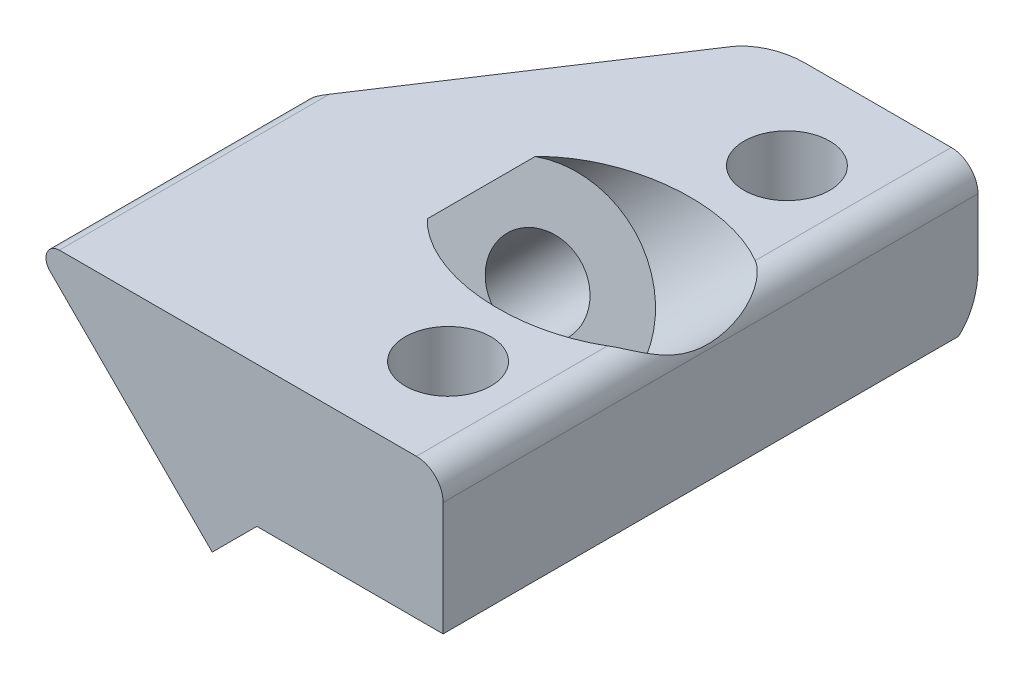
ISO-10303-21;
HEADER;
FILE_DESCRIPTION(('STEP AP214'),'2;1');
FILE_NAME('part.step','',(''),(''),'','','');
FILE_SCHEMA(('AUTOMOTIVE_DESIGN { 1 0 10303 214 1 1 1 1 }'));
ENDSEC;
DATA;
#1=APPLICATION_CONTEXT('core data for automotive mechanical design processes');
#2=APPLICATION_PROTOCOL_DEFINITION('international standard','automotive_design',2000,#1);
#3=PRODUCT_CONTEXT('',#1,'mechanical');
#4=PRODUCT('Part','Part','',(#3));
#5=PRODUCT_RELATED_PRODUCT_CATEGORY('part','',(#4));
#6=PRODUCT_DEFINITION_FORMATION('','',#4);
#7=PRODUCT_DEFINITION_CONTEXT('part definition',#1,'design');
#8=PRODUCT_DEFINITION('design','',#6,#7);
#9=PRODUCT_DEFINITION_SHAPE('','',#8);
#10=(LENGTH_UNIT() NAMED_UNIT(*) SI_UNIT(.MILLI.,.METRE.));
#11=(NAMED_UNIT(*) PLANE_ANGLE_UNIT() SI_UNIT($,.RADIAN.));
#12=(NAMED_UNIT(*) SI_UNIT($,.STERADIAN.) SOLID_ANGLE_UNIT());
#13=UNCERTAINTY_MEASURE_WITH_UNIT(LENGTH_MEASURE(1.E-05),#10,'distance_accuracy_value','');
#14=(GEOMETRIC_REPRESENTATION_CONTEXT(3) GLOBAL_UNCERTAINTY_ASSIGNED_CONTEXT((#13)) GLOBAL_UNIT_ASSIGNED_CONTEXT((#10,
#11,#12)) REPRESENTATION_CONTEXT('',''));
#15=CARTESIAN_POINT('',(0.,0.,0.));
#16=DIRECTION('',(0.,0.,1.));
#17=DIRECTION('',(1.,0.,0.));
#18=AXIS2_PLACEMENT_3D('',#15,#16,#17);
#19=CARTESIAN_POINT('',(8.59176280969094,10.3021303836136,-5.00000000000001));
#20=DIRECTION('',(-0.707106781186548,0.707106781186548,0.));
#21=DIRECTION('',(-0.707106781186548,-0.707106781186548,0.));
#22=AXIS2_PLACEMENT_3D('',#19,#20,#21);
#23=PLANE('',#22);
#24=CARTESIAN_POINT('',(12.0763491861041,13.7867167600267,16.3350447688493));
#25=DIRECTION('',(-0.707106781186548,0.707106781186548,0.));
#26=DIRECTION('',(0.707106781186548,0.707106781186548,0.));
#27=AXIS2_PLACEMENT_3D('',#24,#25,#26);
#28=ELLIPSE('',#27,6.36396103067896,4.5);
#29=CARTESIAN_POINT('',(8.59176280969094,10.3021303836136,19.1824396809253));
#30=VERTEX_POINT('',#29);
#31=CARTESIAN_POINT('',(8.59176280969094,10.3021303836136,13.4876498567733));
#32=VERTEX_POINT('',#31);
#33=EDGE_CURVE('E144',#30,#32,#28,.F.);
#34=ORIENTED_EDGE('',*,*,#33,.F.);
#35=DIRECTION('',(0.,0.,1.));
#36=VECTOR('',#35,1.);
#37=CARTESIAN_POINT('',(8.59176280969094,10.3021303836136,-5.00000000000001));
#38=LINE('',#37,#36);
#39=CARTESIAN_POINT('',(8.59176280969094,10.3021303836136,20.));
#40=VERTEX_POINT('',#39);
#41=EDGE_CURVE('E148',#30,#40,#38,.T.);
#42=ORIENTED_EDGE('',*,*,#41,.T.);
#43=DIRECTION('',(-0.707106781186547,-0.707106781186547,0.));
#44=VECTOR('',#43,1.);
#45=CARTESIAN_POINT('',(8.59176280969094,10.3021303836136,20.));
#46=LINE('',#45,#44);
#47=CARTESIAN_POINT('',(6.92299080609069,8.63335838001336,20.));
#48=VERTEX_POINT('',#47);
#49=EDGE_CURVE('E332',#40,#48,#46,.T.);
#50=ORIENTED_EDGE('',*,*,#49,.T.);
#51=DIRECTION('',(0.,0.,1.));
#52=VECTOR('',#51,1.);
#53=CARTESIAN_POINT('',(6.92299080609069,8.63335838001336,-6.00000000000001));
#54=LINE('',#53,#52);
#55=CARTESIAN_POINT('',(6.92299080609069,8.63335838001336,0.));
#56=VERTEX_POINT('',#55);
#57=EDGE_CURVE('E44',#56,#48,#54,.T.);
#58=ORIENTED_EDGE('',*,*,#57,.F.);
#59=DIRECTION('',(0.707106781186548,0.707106781186548,0.));
#60=VECTOR('',#59,1.);
#61=CARTESIAN_POINT('',(-0.855183786961333,0.855183786961333,0.));
#62=LINE('',#61,#60);
#63=CARTESIAN_POINT('',(8.59176280969094,10.3021303836136,0.));
#64=VERTEX_POINT('',#63);
#65=EDGE_CURVE('E150',#56,#64,#62,.T.);
#66=ORIENTED_EDGE('',*,*,#65,.T.);
#67=CARTESIAN_POINT('',(8.59176280969094,10.3021303836136,0.817560319074722));
#68=VERTEX_POINT('',#67);
#69=EDGE_CURVE('E143',#64,#68,#38,.T.);
#70=ORIENTED_EDGE('',*,*,#69,.T.);
#71=CARTESIAN_POINT('',(12.076349186104,13.7867167600267,3.66495523115073));
#72=DIRECTION('',(-0.707106781186548,0.707106781186548,0.));
#73=DIRECTION('',(0.707106781186548,0.707106781186548,0.));
#74=AXIS2_PLACEMENT_3D('',#71,#72,#73);
#75=ELLIPSE('',#74,6.36396103067896,4.5);
#76=CARTESIAN_POINT('',(8.59176280969094,10.3021303836136,6.51235014322675));
#77=VERTEX_POINT('',#76);
#78=EDGE_CURVE('E136',#77,#68,#75,.F.);
#79=ORIENTED_EDGE('',*,*,#78,.F.);
#80=EDGE_CURVE('E142',#77,#32,#38,.T.);
#81=ORIENTED_EDGE('',*,*,#80,.T.);
#82=EDGE_LOOP('',(#34,#42,#50,#58,#66,#70,#79,#81));
#83=FACE_BOUND('',#82,.T.);
#84=ADVANCED_FACE('F36',(#83),#23,.F.);
#85=CARTESIAN_POINT('',(0.,0.,0.));
#86=DIRECTION('',(0.,0.,-1.));
#87=DIRECTION('',(-1.,0.,0.));
#88=AXIS2_PLACEMENT_3D('',#85,#86,#87);
#89=PLANE('',#88);
#90=ORIENTED_EDGE('',*,*,#65,.F.);
#91=DIRECTION('',(0.707106781186548,-0.707106781186548,0.));
#92=VECTOR('',#91,1.);
#93=CARTESIAN_POINT('',(7.77817459305202,7.77817459305202,0.));
#94=LINE('',#93,#92);
#95=CARTESIAN_POINT('',(4.54453161344022,11.0118175726638,0.));
#96=VERTEX_POINT('',#95);
#97=EDGE_CURVE('E184',#96,#56,#94,.T.);
#98=ORIENTED_EDGE('',*,*,#97,.F.);
#99=DIRECTION('',(-0.707106781186548,-0.707106781186547,0.));
#100=VECTOR('',#99,1.);
#101=CARTESIAN_POINT('',(8.41334817461653,14.8806341338401,0.));
#102=LINE('',#101,#100);
#103=CARTESIAN_POINT('',(9.08906322688043,15.556349186104,0.));
#104=VERTEX_POINT('',#103);
#105=EDGE_CURVE('E231',#96,#104,#102,.F.);
#106=ORIENTED_EDGE('',*,*,#105,.T.);
#107=DIRECTION('',(1.,0.,0.));
#108=VECTOR('',#107,1.);
#109=CARTESIAN_POINT('',(15.556349186104,15.556349186104,0.));
#110=LINE('',#109,#108);
#111=CARTESIAN_POINT('',(14.556349186104,15.556349186104,0.));
#112=VERTEX_POINT('',#111);
#113=EDGE_CURVE('E200',#104,#112,#110,.T.);
#114=ORIENTED_EDGE('',*,*,#113,.T.);
#115=CARTESIAN_POINT('',(14.556349186104,14.556349186104,0.));
#116=DIRECTION('',(0.,0.,-1.));
#117=DIRECTION('',(-1.,0.,0.));
#118=AXIS2_PLACEMENT_3D('',#115,#116,#117);
#119=CIRCLE('',#118,1.);
#120=CARTESIAN_POINT('',(15.556349186104,14.556349186104,0.));
#121=VERTEX_POINT('',#120);
#122=EDGE_CURVE('E216',#112,#121,#119,.T.);
#123=ORIENTED_EDGE('',*,*,#122,.T.);
#124=DIRECTION('',(0.,-1.,0.));
#125=VECTOR('',#124,1.);
#126=CARTESIAN_POINT('',(15.556349186104,0.,0.));
#127=LINE('',#126,#125);
#128=CARTESIAN_POINT('',(15.556349186104,12.1189793929886,0.));
#129=VERTEX_POINT('',#128);
#130=EDGE_CURVE('E193',#121,#129,#127,.T.);
#131=ORIENTED_EDGE('',*,*,#130,.T.);
#132=DIRECTION('',(-0.707106781186548,-0.707106781186547,0.));
#133=VECTOR('',#132,1.);
#134=CARTESIAN_POINT('',(9.49685948960976,6.05948969649428,0.));
#135=LINE('',#134,#133);
#136=CARTESIAN_POINT('',(13.7395001767291,10.3021303836136,0.));
#137=VERTEX_POINT('',#136);
#138=EDGE_CURVE('E233',#129,#137,#135,.T.);
#139=ORIENTED_EDGE('',*,*,#138,.T.);
#140=DIRECTION('',(1.,0.,0.));
#141=VECTOR('',#140,1.);
#142=CARTESIAN_POINT('',(0.,10.3021303836137,0.));
#143=LINE('',#142,#141);
#144=EDGE_CURVE('E159',#64,#137,#143,.T.);
#145=ORIENTED_EDGE('',*,*,#144,.F.);
#146=EDGE_LOOP('',(#90,#98,#106,#114,#123,#131,#139,#145));
#147=FACE_BOUND('',#146,.T.);
#148=ADVANCED_FACE('F284',(#147),#89,.T.);
#149=CARTESIAN_POINT('',(15.556349186104,15.556349186104,20.));
#150=DIRECTION('',(0.,1.,0.));
#151=DIRECTION('',(-1.,0.,0.));
#152=AXIS2_PLACEMENT_3D('',#149,#150,#151);
#153=PLANE('',#152);
#154=CARTESIAN_POINT('',(11.2878351542816,15.556349186104,10.0897155538725));
#155=DIRECTION('',(0.,1.,0.));
#156=DIRECTION('',(-1.,0.,0.));
#157=AXIS2_PLACEMENT_3D('',#154,#155,#156);
#158=ELLIPSE('',#157,5.09116882454314,3.6);
#159=CARTESIAN_POINT('',(7.07106781186548,15.556349186104,12.1070000132302));
#160=VERTEX_POINT('',#159);
#161=CARTESIAN_POINT('',(14.556349186104,15.556349186104,12.8498619289566));
#162=VERTEX_POINT('',#161);
#163=EDGE_CURVE('E175',#160,#162,#158,.T.);
#164=ORIENTED_EDGE('',*,*,#163,.F.);
#165=DIRECTION('',(0.,0.,1.));
#166=VECTOR('',#165,1.);
#167=CARTESIAN_POINT('',(7.07106781186548,15.556349186104,20.));
#168=LINE('',#167,#166);
#169=CARTESIAN_POINT('',(7.07106781186548,15.556349186104,8.07243109451473));
#170=VERTEX_POINT('',#169);
#171=EDGE_CURVE('E171',#170,#160,#168,.T.);
#172=ORIENTED_EDGE('',*,*,#171,.F.);
#173=CARTESIAN_POINT('',(14.556349186104,15.556349186104,7.32956917878835));
#174=VERTEX_POINT('',#173);
#175=EDGE_CURVE('E173',#174,#170,#158,.T.);
#176=ORIENTED_EDGE('',*,*,#175,.F.);
#177=DIRECTION('',(0.,0.,-1.));
#178=VECTOR('',#177,1.);
#179=CARTESIAN_POINT('',(14.556349186104,15.556349186104,20.));
#180=LINE('',#179,#178);
#181=EDGE_CURVE('E212',#174,#112,#180,.T.);
#182=ORIENTED_EDGE('',*,*,#181,.T.);
#183=ORIENTED_EDGE('',*,*,#113,.F.);
#184=CARTESIAN_POINT('',(9.08906322688043,15.556349186104,1.5));
#185=DIRECTION('',(0.,1.,0.));
#186=DIRECTION('',(1.,0.,0.));
#187=AXIS2_PLACEMENT_3D('',#184,#185,#186);
#188=ELLIPSE('',#187,2.12132034355964,1.5);
#189=CARTESIAN_POINT('',(7.16649408071306,15.556349186104,0.866072607388961));
#190=VERTEX_POINT('',#189);
#191=EDGE_CURVE('E241',#104,#190,#188,.T.);
#192=ORIENTED_EDGE('',*,*,#191,.T.);
#193=DIRECTION('',(-0.550527347484624,0.,0.834817129478992));
#194=VECTOR('',#193,1.);
#195=CARTESIAN_POINT('',(0.915539205724358,15.556349186104,10.3449917366272));
#196=LINE('',#195,#194);
#197=CARTESIAN_POINT('',(1.20710678118655,15.556349186104,9.90286001054924));
#198=VERTEX_POINT('',#197);
#199=EDGE_CURVE('E187',#190,#198,#196,.T.);
#200=ORIENTED_EDGE('',*,*,#199,.T.);
#201=DIRECTION('',(0.,0.,-1.));
#202=VECTOR('',#201,1.);
#203=CARTESIAN_POINT('',(1.20710678118655,15.556349186104,20.));
#204=LINE('',#203,#202);
#205=CARTESIAN_POINT('',(1.20710678118655,15.556349186104,20.));
#206=VERTEX_POINT('',#205);
#207=EDGE_CURVE('E226',#198,#206,#204,.F.);
#208=ORIENTED_EDGE('',*,*,#207,.T.);
#209=DIRECTION('',(1.,0.,0.));
#210=VECTOR('',#209,1.);
#211=CARTESIAN_POINT('',(15.556349186104,15.556349186104,20.));
#212=LINE('',#211,#210);
#213=CARTESIAN_POINT('',(14.556349186104,15.556349186104,20.));
#214=VERTEX_POINT('',#213);
#215=EDGE_CURVE('E199',#206,#214,#212,.T.);
#216=ORIENTED_EDGE('',*,*,#215,.T.);
#217=EDGE_CURVE('E213',#214,#162,#180,.T.);
#218=ORIENTED_EDGE('',*,*,#217,.T.);
#219=EDGE_LOOP('',(#164,#172,#176,#182,#183,#192,#200,#208,#216,#218));
#220=FACE_BOUND('',#219,.T.);
#221=CARTESIAN_POINT('',(12.076349186104,15.556349186104,16.3350447688493));
#222=DIRECTION('',(0.,-1.,0.));
#223=DIRECTION('',(0.,0.,1.));
#224=AXIS2_PLACEMENT_3D('',#221,#222,#223);
#225=CIRCLE('',#224,1.6);
#226=CARTESIAN_POINT('',(10.476349186104,15.556349186104,16.3350447688493));
#227=VERTEX_POINT('',#226);
#228=EDGE_CURVE('E190',#227,#227,#225,.T.);
#229=ORIENTED_EDGE('',*,*,#228,.T.);
#230=EDGE_LOOP('',(#229));
#231=FACE_BOUND('',#230,.T.);
#232=CARTESIAN_POINT('',(12.076349186104,15.556349186104,3.66495523115073));
#233=DIRECTION('',(0.,-1.,0.));
#234=DIRECTION('',(0.,0.,1.));
#235=AXIS2_PLACEMENT_3D('',#232,#233,#234);
#236=CIRCLE('',#235,1.6);
#237=CARTESIAN_POINT('',(10.476349186104,15.556349186104,3.66495523115073));
#238=VERTEX_POINT('',#237);
#239=EDGE_CURVE('E189',#238,#238,#236,.T.);
#240=ORIENTED_EDGE('',*,*,#239,.T.);
#241=EDGE_LOOP('',(#240));
#242=FACE_BOUND('',#241,.T.);
#243=ADVANCED_FACE('F280',(#220,#231,#242),#153,.T.);
#244=CARTESIAN_POINT('',(1.20710678118655,15.056349186104,20.));
#245=DIRECTION('',(0.,0.,-1.));
#246=DIRECTION('',(-1.,0.,0.));
#247=AXIS2_PLACEMENT_3D('',#244,#245,#246);
#248=CYLINDRICAL_SURFACE('',#247,0.5);
#249=ORIENTED_EDGE('',*,*,#207,.F.);
#250=CARTESIAN_POINT('',(1.20710678118655,15.056349186104,9.14466231765233));
#251=DIRECTION('',(-0.640856382055791,0.640856382055791,-0.422618261740693));
#252=DIRECTION('',(0.298836238730115,-0.298836238730115,-0.906307787036653));
#253=AXIS2_PLACEMENT_3D('',#250,#251,#252);
#254=ELLIPSE('',#253,1.18310079157627,0.5);
#255=CARTESIAN_POINT('',(0.853553390593274,14.7027957955108,9.14466231765233));
#256=VERTEX_POINT('',#255);
#257=EDGE_CURVE('E228',#198,#256,#254,.F.);
#258=ORIENTED_EDGE('',*,*,#257,.T.);
#259=DIRECTION('',(0.,0.,-1.));
#260=VECTOR('',#259,1.);
#261=CARTESIAN_POINT('',(0.853553390593275,14.7027957955108,20.));
#262=LINE('',#261,#260);
#263=CARTESIAN_POINT('',(0.853553390593275,14.7027957955108,20.));
#264=VERTEX_POINT('',#263);
#265=EDGE_CURVE('E202',#256,#264,#262,.F.);
#266=ORIENTED_EDGE('',*,*,#265,.T.);
#267=CARTESIAN_POINT('',(1.20710678118655,15.056349186104,20.));
#268=DIRECTION('',(0.,0.,-1.));
#269=DIRECTION('',(-1.,0.,0.));
#270=AXIS2_PLACEMENT_3D('',#267,#268,#269);
#271=CIRCLE('',#270,0.5);
#272=EDGE_CURVE('E223',#206,#264,#271,.F.);
#273=ORIENTED_EDGE('',*,*,#272,.F.);
#274=EDGE_LOOP('',(#249,#258,#266,#273));
#275=FACE_BOUND('',#274,.T.);
#276=ADVANCED_FACE('F283',(#275),#248,.T.);
#277=CARTESIAN_POINT('',(0.,0.,20.));
#278=DIRECTION('',(0.,0.,-1.));
#279=DIRECTION('',(-1.,0.,0.));
#280=AXIS2_PLACEMENT_3D('',#277,#278,#279);
#281=PLANE('',#280);
#282=DIRECTION('',(-0.707106781186547,0.707106781186547,0.));
#283=VECTOR('',#282,1.);
#284=CARTESIAN_POINT('',(0.853553390593275,14.7027957955108,20.));
#285=LINE('',#284,#283);
#286=EDGE_CURVE('E179',#48,#264,#285,.T.);
#287=ORIENTED_EDGE('',*,*,#286,.F.);
#288=ORIENTED_EDGE('',*,*,#49,.F.);
#289=DIRECTION('',(-1.,0.,0.));
#290=VECTOR('',#289,1.);
#291=CARTESIAN_POINT('',(15.8608205202887,10.3021303836136,20.));
#292=LINE('',#291,#290);
#293=CARTESIAN_POINT('',(15.556349186104,10.3021303836136,20.));
#294=VERTEX_POINT('',#293);
#295=EDGE_CURVE('E152',#294,#40,#292,.T.);
#296=ORIENTED_EDGE('',*,*,#295,.F.);
#297=DIRECTION('',(0.,-1.,0.));
#298=VECTOR('',#297,1.);
#299=CARTESIAN_POINT('',(15.556349186104,0.,20.));
#300=LINE('',#299,#298);
#301=CARTESIAN_POINT('',(15.556349186104,14.556349186104,20.));
#302=VERTEX_POINT('',#301);
#303=EDGE_CURVE('E196',#302,#294,#300,.T.);
#304=ORIENTED_EDGE('',*,*,#303,.F.);
#305=CARTESIAN_POINT('',(14.556349186104,14.556349186104,20.));
#306=DIRECTION('',(0.,0.,-1.));
#307=DIRECTION('',(-1.,0.,0.));
#308=AXIS2_PLACEMENT_3D('',#305,#306,#307);
#309=CIRCLE('',#308,1.);
#310=EDGE_CURVE('E220',#302,#214,#309,.F.);
#311=ORIENTED_EDGE('',*,*,#310,.T.);
#312=ORIENTED_EDGE('',*,*,#215,.F.);
#313=ORIENTED_EDGE('',*,*,#272,.T.);
#314=EDGE_LOOP('',(#287,#288,#296,#304,#311,#312,#313));
#315=FACE_BOUND('',#314,.T.);
#316=ADVANCED_FACE('F289',(#315),#281,.F.);
#317=CARTESIAN_POINT('',(15.556349186104,0.,20.));
#318=DIRECTION('',(1.,0.,0.));
#319=DIRECTION('',(0.,1.,0.));
#320=AXIS2_PLACEMENT_3D('',#317,#318,#319);
#321=PLANE('',#320);
#322=DIRECTION('',(0.,0.,1.));
#323=VECTOR('',#322,1.);
#324=CARTESIAN_POINT('',(15.556349186104,10.3021303836136,20.));
#325=LINE('',#324,#323);
#326=CARTESIAN_POINT('',(15.556349186104,10.3021303836136,0.725706878135571));
#327=VERTEX_POINT('',#326);
#328=EDGE_CURVE('E157',#327,#294,#325,.T.);
#329=ORIENTED_EDGE('',*,*,#328,.F.);
#330=CARTESIAN_POINT('',(15.556349186104,12.1189793929886,1.5));
#331=DIRECTION('',(1.,0.,0.));
#332=DIRECTION('',(0.,1.,0.));
#333=AXIS2_PLACEMENT_3D('',#330,#331,#332);
#334=ELLIPSE('',#333,2.12132034355964,1.5);
#335=EDGE_CURVE('E236',#327,#129,#334,.T.);
#336=ORIENTED_EDGE('',*,*,#335,.T.);
#337=ORIENTED_EDGE('',*,*,#130,.F.);
#338=DIRECTION('',(0.,0.,-1.));
#339=VECTOR('',#338,1.);
#340=CARTESIAN_POINT('',(15.556349186104,14.556349186104,20.));
#341=LINE('',#340,#339);
#342=EDGE_CURVE('E218',#121,#302,#341,.F.);
#343=ORIENTED_EDGE('',*,*,#342,.T.);
#344=ORIENTED_EDGE('',*,*,#303,.T.);
#345=EDGE_LOOP('',(#329,#336,#337,#343,#344));
#346=FACE_BOUND('',#345,.T.);
#347=ADVANCED_FACE('F286',(#346),#321,.T.);
#348=CARTESIAN_POINT('',(-6.93584908481267,8.35006264718577,11.3232210561494));
#349=DIRECTION('',(0.640856382055791,-0.640856382055791,0.422618261740693));
#350=DIRECTION('',(0.707106781186547,0.707106781186547,0.));
#351=AXIS2_PLACEMENT_3D('',#348,#349,#350);
#352=PLANE('',#351);
#353=DIRECTION('',(-0.707106781186548,-0.707106781186547,0.));
#354=VECTOR('',#353,1.);
#355=CARTESIAN_POINT('',(3.58324704035653,11.9731021457475,0.86607260738896));
#356=LINE('',#355,#354);
#357=CARTESIAN_POINT('',(3.58324704035653,11.9731021457475,0.866072607388961));
#358=VERTEX_POINT('',#357);
#359=EDGE_CURVE('E238',#190,#358,#356,.T.);
#360=ORIENTED_EDGE('',*,*,#359,.T.);
#361=DIRECTION('',(-0.298836238730115,0.298836238730115,0.906307787036653));
#362=VECTOR('',#361,1.);
#363=CARTESIAN_POINT('',(0.135218727052804,15.4211304590512,11.3232210561494));
#364=LINE('',#363,#362);
#365=EDGE_CURVE('E181',#358,#256,#364,.T.);
#366=ORIENTED_EDGE('',*,*,#365,.T.);
#367=ORIENTED_EDGE('',*,*,#257,.F.);
#368=ORIENTED_EDGE('',*,*,#199,.F.);
#369=EDGE_LOOP('',(#360,#366,#367,#368));
#370=FACE_BOUND('',#369,.T.);
#371=ADVANCED_FACE('F278',(#370),#352,.F.);
#372=CARTESIAN_POINT('',(12.076349186104,0.,3.66495523115073));
#373=DIRECTION('',(0.,1.,0.));
#374=DIRECTION('',(-1.,0.,0.));
#375=AXIS2_PLACEMENT_3D('',#372,#373,#374);
#376=CYLINDRICAL_SURFACE('',#375,1.6);
#377=CARTESIAN_POINT('',(12.076349186104,10.3021303836136,3.66495523115073));
#378=DIRECTION('',(0.,1.,0.));
#379=DIRECTION('',(-1.,0.,0.));
#380=AXIS2_PLACEMENT_3D('',#377,#378,#379);
#381=CIRCLE('',#380,1.6);
#382=CARTESIAN_POINT('',(10.476349186104,10.3021303836136,3.66495523115073));
#383=VERTEX_POINT('',#382);
#384=EDGE_CURVE('E164',#383,#383,#381,.T.);
#385=CARTESIAN_POINT('',(10.476349186104,10.3021303836136,3.66495523115073));
#386=CARTESIAN_POINT('',(10.476349186104,10.3568618294729,3.66495523115073));
#387=CARTESIAN_POINT('',(10.476349186104,10.4115932753321,3.66495523115073));
#388=CARTESIAN_POINT('',(10.476349186104,10.5210561670507,3.66495523115073));
#389=CARTESIAN_POINT('',(10.476349186104,10.57578761291,3.66495523115073));
#390=CARTESIAN_POINT('',(10.476349186104,10.6852505046285,3.66495523115073));
#391=CARTESIAN_POINT('',(10.476349186104,10.7399819504878,3.66495523115073));
#392=CARTESIAN_POINT('',(10.476349186104,10.8494448422064,3.66495523115073));
#393=CARTESIAN_POINT('',(10.476349186104,10.9041762880656,3.66495523115073));
#394=CARTESIAN_POINT('',(10.476349186104,11.0136391797842,3.66495523115073));
#395=CARTESIAN_POINT('',(10.476349186104,11.0683706256435,3.66495523115073));
#396=CARTESIAN_POINT('',(10.476349186104,11.177833517362,3.66495523115073));
#397=CARTESIAN_POINT('',(10.476349186104,11.2325649632213,3.66495523115073));
#398=CARTESIAN_POINT('',(10.476349186104,11.3420278549398,3.66495523115073));
#399=CARTESIAN_POINT('',(10.476349186104,11.3967593007991,3.66495523115073));
#400=CARTESIAN_POINT('',(10.476349186104,11.5062221925177,3.66495523115073));
#401=CARTESIAN_POINT('',(10.476349186104,11.5609536383769,3.66495523115073));
#402=CARTESIAN_POINT('',(10.476349186104,11.6704165300955,3.66495523115073));
#403=CARTESIAN_POINT('',(10.476349186104,11.7251479759548,3.66495523115073));
#404=CARTESIAN_POINT('',(10.476349186104,11.8346108676733,3.66495523115073));
#405=CARTESIAN_POINT('',(10.476349186104,11.8893423135326,3.66495523115073));
#406=CARTESIAN_POINT('',(10.476349186104,11.9988052052511,3.66495523115073));
#407=CARTESIAN_POINT('',(10.476349186104,12.0535366511104,3.66495523115073));
#408=CARTESIAN_POINT('',(10.476349186104,12.162999542829,3.66495523115073));
#409=CARTESIAN_POINT('',(10.476349186104,12.2177309886882,3.66495523115073));
#410=CARTESIAN_POINT('',(10.476349186104,12.3271938804068,3.66495523115073));
#411=CARTESIAN_POINT('',(10.476349186104,12.3819253262661,3.66495523115073));
#412=CARTESIAN_POINT('',(10.476349186104,12.4913882179846,3.66495523115073));
#413=CARTESIAN_POINT('',(10.476349186104,12.5461196638439,3.66495523115073));
#414=CARTESIAN_POINT('',(10.476349186104,12.6555825555624,3.66495523115073));
#415=CARTESIAN_POINT('',(10.476349186104,12.7103140014217,3.66495523115073));
#416=CARTESIAN_POINT('',(10.476349186104,12.8197768931403,3.66495523115073));
#417=CARTESIAN_POINT('',(10.476349186104,12.8745083389995,3.66495523115073));
#418=CARTESIAN_POINT('',(10.476349186104,12.9839712307181,3.66495523115073));
#419=CARTESIAN_POINT('',(10.476349186104,13.0387026765774,3.66495523115073));
#420=CARTESIAN_POINT('',(10.476349186104,13.1481655682959,3.66495523115073));
#421=CARTESIAN_POINT('',(10.476349186104,13.2028970141552,3.66495523115073));
#422=CARTESIAN_POINT('',(10.476349186104,13.3123599058738,3.66495523115073));
#423=CARTESIAN_POINT('',(10.476349186104,13.367091351733,3.66495523115073));
#424=CARTESIAN_POINT('',(10.476349186104,13.4765542434516,3.66495523115073));
#425=CARTESIAN_POINT('',(10.476349186104,13.5312856893109,3.66495523115073));
#426=CARTESIAN_POINT('',(10.476349186104,13.6407485810294,3.66495523115073));
#427=CARTESIAN_POINT('',(10.476349186104,13.6954800268887,3.66495523115073));
#428=CARTESIAN_POINT('',(10.476349186104,13.8049429186072,3.66495523115073));
#429=CARTESIAN_POINT('',(10.476349186104,13.8596743644665,3.66495523115073));
#430=CARTESIAN_POINT('',(10.476349186104,13.9691372561851,3.66495523115073));
#431=CARTESIAN_POINT('',(10.476349186104,14.0238687020443,3.66495523115073));
#432=CARTESIAN_POINT('',(10.476349186104,14.1333315937629,3.66495523115073));
#433=CARTESIAN_POINT('',(10.476349186104,14.1880630396222,3.66495523115073));
#434=CARTESIAN_POINT('',(10.476349186104,14.2975259313407,3.66495523115073));
#435=CARTESIAN_POINT('',(10.476349186104,14.3522573772,3.66495523115073));
#436=CARTESIAN_POINT('',(10.476349186104,14.4617202689185,3.66495523115073));
#437=CARTESIAN_POINT('',(10.476349186104,14.5164517147778,3.66495523115073));
#438=CARTESIAN_POINT('',(10.476349186104,14.6259146064964,3.66495523115073));
#439=CARTESIAN_POINT('',(10.476349186104,14.6806460523556,3.66495523115073));
#440=CARTESIAN_POINT('',(10.476349186104,14.7901089440742,3.66495523115073));
#441=CARTESIAN_POINT('',(10.476349186104,14.8448403899335,3.66495523115073));
#442=CARTESIAN_POINT('',(10.476349186104,14.954303281652,3.66495523115073));
#443=CARTESIAN_POINT('',(10.476349186104,15.0090347275113,3.66495523115073));
#444=CARTESIAN_POINT('',(10.476349186104,15.1184976192298,3.66495523115073));
#445=CARTESIAN_POINT('',(10.476349186104,15.1732290650891,3.66495523115073));
#446=CARTESIAN_POINT('',(10.476349186104,15.2826919568077,3.66495523115073));
#447=CARTESIAN_POINT('',(10.476349186104,15.3374234026669,3.66495523115073));
#448=CARTESIAN_POINT('',(10.476349186104,15.4468862943855,3.66495523115073));
#449=CARTESIAN_POINT('',(10.476349186104,15.5016177402448,3.66495523115073));
#450=CARTESIAN_POINT('',(10.476349186104,15.556349186104,3.66495523115073));
#451=B_SPLINE_CURVE_WITH_KNOTS('',3,(#385,#386,#387,#388,#389,#390,#391,#392,#393,#394,#395,
#396,#397,#398,#399,#400,#401,#402,#403,#404,#405,#406,#407,#408,#409,#410,#411,#412,#413,#414,
#415,#416,#417,#418,#419,#420,#421,#422,#423,#424,#425,#426,#427,#428,#429,#430,#431,#432,#433,
#434,#435,#436,#437,#438,#439,#440,#441,#442,#443,#444,#445,#446,#447,#448,#449,#450),
.UNSPECIFIED.,.F.,.F.,(4,2,2,2,2,2,2,2,2,2,2,2,2,2,2,2,2,2,2,2,2,2,2,2,2,2,2,2,2,2,2,2,4),(0.,
0.164194337577826,0.328388675155653,0.49258301273348,0.656777350311307,0.820971687889133,
0.985166025466959,1.14936036304479,1.31355470062261,1.47774903820044,1.64194337577827,
1.80613771335609,1.97033205093392,2.13452638851174,2.29872072608957,2.4629150636674,
2.62710940124523,2.79130373882305,2.95549807640088,3.11969241397871,3.28388675155653,
3.44808108913436,3.61227542671218,3.77646976429001,3.94066410186784,4.10485843944566,
4.26905277702349,4.43324711460132,4.59744145217914,4.76163578975697,4.9258301273348,
5.09002446491262,5.25421880249045),.UNSPECIFIED.);
#452=EDGE_CURVE('BSEAM274',#383,#238,#451,.T.);
#453=ORIENTED_EDGE('',*,*,#384,.F.);
#454=ORIENTED_EDGE('',*,*,#239,.F.);
#455=ORIENTED_EDGE('',*,*,#452,.T.);
#456=ORIENTED_EDGE('',*,*,#452,.F.);
#457=EDGE_LOOP('',(#453,#455,#454,#456));
#458=FACE_BOUND('',#457,.T.);
#459=ADVANCED_FACE('F274',(#458),#376,.F.);
#460=CARTESIAN_POINT('',(12.076349186104,0.,16.3350447688493));
#461=DIRECTION('',(0.,1.,0.));
#462=DIRECTION('',(-1.,0.,0.));
#463=AXIS2_PLACEMENT_3D('',#460,#461,#462);
#464=CYLINDRICAL_SURFACE('',#463,1.6);
#465=CARTESIAN_POINT('',(12.076349186104,10.3021303836136,16.3350447688493));
#466=DIRECTION('',(0.,1.,0.));
#467=DIRECTION('',(-1.,0.,0.));
#468=AXIS2_PLACEMENT_3D('',#465,#466,#467);
#469=CIRCLE('',#468,1.6);
#470=CARTESIAN_POINT('',(10.476349186104,10.3021303836136,16.3350447688493));
#471=VERTEX_POINT('',#470);
#472=EDGE_CURVE('E161',#471,#471,#469,.T.);
#473=CARTESIAN_POINT('',(10.476349186104,10.3021303836136,16.3350447688493));
#474=CARTESIAN_POINT('',(10.476349186104,10.3568618294729,16.3350447688493));
#475=CARTESIAN_POINT('',(10.476349186104,10.4115932753321,16.3350447688493));
#476=CARTESIAN_POINT('',(10.476349186104,10.5210561670507,16.3350447688493));
#477=CARTESIAN_POINT('',(10.476349186104,10.57578761291,16.3350447688493));
#478=CARTESIAN_POINT('',(10.476349186104,10.6852505046285,16.3350447688493));
#479=CARTESIAN_POINT('',(10.476349186104,10.7399819504878,16.3350447688493));
#480=CARTESIAN_POINT('',(10.476349186104,10.8494448422064,16.3350447688493));
#481=CARTESIAN_POINT('',(10.476349186104,10.9041762880656,16.3350447688493));
#482=CARTESIAN_POINT('',(10.476349186104,11.0136391797842,16.3350447688493));
#483=CARTESIAN_POINT('',(10.476349186104,11.0683706256435,16.3350447688493));
#484=CARTESIAN_POINT('',(10.476349186104,11.177833517362,16.3350447688493));
#485=CARTESIAN_POINT('',(10.476349186104,11.2325649632213,16.3350447688493));
#486=CARTESIAN_POINT('',(10.476349186104,11.3420278549398,16.3350447688493));
#487=CARTESIAN_POINT('',(10.476349186104,11.3967593007991,16.3350447688493));
#488=CARTESIAN_POINT('',(10.476349186104,11.5062221925177,16.3350447688493));
#489=CARTESIAN_POINT('',(10.476349186104,11.5609536383769,16.3350447688493));
#490=CARTESIAN_POINT('',(10.476349186104,11.6704165300955,16.3350447688493));
#491=CARTESIAN_POINT('',(10.476349186104,11.7251479759548,16.3350447688493));
#492=CARTESIAN_POINT('',(10.476349186104,11.8346108676733,16.3350447688493));
#493=CARTESIAN_POINT('',(10.476349186104,11.8893423135326,16.3350447688493));
#494=CARTESIAN_POINT('',(10.476349186104,11.9988052052511,16.3350447688493));
#495=CARTESIAN_POINT('',(10.476349186104,12.0535366511104,16.3350447688493));
#496=CARTESIAN_POINT('',(10.476349186104,12.162999542829,16.3350447688493));
#497=CARTESIAN_POINT('',(10.476349186104,12.2177309886882,16.3350447688493));
#498=CARTESIAN_POINT('',(10.476349186104,12.3271938804068,16.3350447688493));
#499=CARTESIAN_POINT('',(10.476349186104,12.3819253262661,16.3350447688493));
#500=CARTESIAN_POINT('',(10.476349186104,12.4913882179846,16.3350447688493));
#501=CARTESIAN_POINT('',(10.476349186104,12.5461196638439,16.3350447688493));
#502=CARTESIAN_POINT('',(10.476349186104,12.6555825555624,16.3350447688493));
#503=CARTESIAN_POINT('',(10.476349186104,12.7103140014217,16.3350447688493));
#504=CARTESIAN_POINT('',(10.476349186104,12.8197768931403,16.3350447688493));
#505=CARTESIAN_POINT('',(10.476349186104,12.8745083389995,16.3350447688493));
#506=CARTESIAN_POINT('',(10.476349186104,12.9839712307181,16.3350447688493));
#507=CARTESIAN_POINT('',(10.476349186104,13.0387026765774,16.3350447688493));
#508=CARTESIAN_POINT('',(10.476349186104,13.1481655682959,16.3350447688493));
#509=CARTESIAN_POINT('',(10.476349186104,13.2028970141552,16.3350447688493));
#510=CARTESIAN_POINT('',(10.476349186104,13.3123599058738,16.3350447688493));
#511=CARTESIAN_POINT('',(10.476349186104,13.367091351733,16.3350447688493));
#512=CARTESIAN_POINT('',(10.476349186104,13.4765542434516,16.3350447688493));
#513=CARTESIAN_POINT('',(10.476349186104,13.5312856893109,16.3350447688493));
#514=CARTESIAN_POINT('',(10.476349186104,13.6407485810294,16.3350447688493));
#515=CARTESIAN_POINT('',(10.476349186104,13.6954800268887,16.3350447688493));
#516=CARTESIAN_POINT('',(10.476349186104,13.8049429186072,16.3350447688493));
#517=CARTESIAN_POINT('',(10.476349186104,13.8596743644665,16.3350447688493));
#518=CARTESIAN_POINT('',(10.476349186104,13.9691372561851,16.3350447688493));
#519=CARTESIAN_POINT('',(10.476349186104,14.0238687020443,16.3350447688493));
#520=CARTESIAN_POINT('',(10.476349186104,14.1333315937629,16.3350447688493));
#521=CARTESIAN_POINT('',(10.476349186104,14.1880630396222,16.3350447688493));
#522=CARTESIAN_POINT('',(10.476349186104,14.2975259313407,16.3350447688493));
#523=CARTESIAN_POINT('',(10.476349186104,14.3522573772,16.3350447688493));
#524=CARTESIAN_POINT('',(10.476349186104,14.4617202689185,16.3350447688493));
#525=CARTESIAN_POINT('',(10.476349186104,14.5164517147778,16.3350447688493));
#526=CARTESIAN_POINT('',(10.476349186104,14.6259146064964,16.3350447688493));
#527=CARTESIAN_POINT('',(10.476349186104,14.6806460523556,16.3350447688493));
#528=CARTESIAN_POINT('',(10.476349186104,14.7901089440742,16.3350447688493));
#529=CARTESIAN_POINT('',(10.476349186104,14.8448403899335,16.3350447688493));
#530=CARTESIAN_POINT('',(10.476349186104,14.954303281652,16.3350447688493));
#531=CARTESIAN_POINT('',(10.476349186104,15.0090347275113,16.3350447688493));
#532=CARTESIAN_POINT('',(10.476349186104,15.1184976192298,16.3350447688493));
#533=CARTESIAN_POINT('',(10.476349186104,15.1732290650891,16.3350447688493));
#534=CARTESIAN_POINT('',(10.476349186104,15.2826919568077,16.3350447688493));
#535=CARTESIAN_POINT('',(10.476349186104,15.3374234026669,16.3350447688493));
#536=CARTESIAN_POINT('',(10.476349186104,15.4468862943855,16.3350447688493));
#537=CARTESIAN_POINT('',(10.476349186104,15.5016177402448,16.3350447688493));
#538=CARTESIAN_POINT('',(10.476349186104,15.556349186104,16.3350447688493));
#539=B_SPLINE_CURVE_WITH_KNOTS('',3,(#473,#474,#475,#476,#477,#478,#479,#480,#481,#482,#483,
#484,#485,#486,#487,#488,#489,#490,#491,#492,#493,#494,#495,#496,#497,#498,#499,#500,#501,#502,
#503,#504,#505,#506,#507,#508,#509,#510,#511,#512,#513,#514,#515,#516,#517,#518,#519,#520,#521,
#522,#523,#524,#525,#526,#527,#528,#529,#530,#531,#532,#533,#534,#535,#536,#537,#538),
.UNSPECIFIED.,.F.,.F.,(4,2,2,2,2,2,2,2,2,2,2,2,2,2,2,2,2,2,2,2,2,2,2,2,2,2,2,2,2,2,2,2,4),(0.,
0.164194337577826,0.328388675155653,0.49258301273348,0.656777350311307,0.820971687889133,
0.985166025466959,1.14936036304479,1.31355470062261,1.47774903820044,1.64194337577827,
1.80613771335609,1.97033205093392,2.13452638851174,2.29872072608957,2.4629150636674,
2.62710940124523,2.79130373882305,2.95549807640088,3.11969241397871,3.28388675155653,
3.44808108913436,3.61227542671218,3.77646976429001,3.94066410186784,4.10485843944566,
4.26905277702349,4.43324711460132,4.59744145217914,4.76163578975697,4.9258301273348,
5.09002446491262,5.25421880249045),.UNSPECIFIED.);
#540=EDGE_CURVE('BSEAM271',#471,#227,#539,.T.);
#541=ORIENTED_EDGE('',*,*,#472,.F.);
#542=ORIENTED_EDGE('',*,*,#228,.F.);
#543=ORIENTED_EDGE('',*,*,#540,.T.);
#544=ORIENTED_EDGE('',*,*,#540,.F.);
#545=EDGE_LOOP('',(#541,#543,#542,#544));
#546=FACE_BOUND('',#545,.T.);
#547=ADVANCED_FACE('F271',(#546),#464,.F.);
#548=CARTESIAN_POINT('',(14.556349186104,14.556349186104,20.));
#549=DIRECTION('',(0.,0.,-1.));
#550=DIRECTION('',(-1.,0.,0.));
#551=AXIS2_PLACEMENT_3D('',#548,#549,#550);
#552=CYLINDRICAL_SURFACE('',#551,1.);
#553=CARTESIAN_POINT('',(14.556349186104,15.556349186104,12.8498619289566));
#554=CARTESIAN_POINT('',(14.5873910414726,15.5563498122466,12.8314882398642));
#555=CARTESIAN_POINT('',(14.617825246045,15.5549043014091,12.8121613982295));
#556=CARTESIAN_POINT('',(14.6772248075852,15.5494636897351,12.7718009802416));
#557=CARTESIAN_POINT('',(14.7061927654642,15.5454732874287,12.750770611377));
#558=CARTESIAN_POINT('',(14.7900002688565,15.5303121606044,12.6858472222495));
#559=CARTESIAN_POINT('',(14.8425076823207,15.5159343776309,12.6396665315063));
#560=CARTESIAN_POINT('',(14.9572855270056,15.4751216533414,12.5257847926737));
#561=CARTESIAN_POINT('',(15.0167109423416,15.446241284848,12.4561416856479));
#562=CARTESIAN_POINT('',(15.1234380620842,15.3823665772298,12.3102253758918));
#563=CARTESIAN_POINT('',(15.1706697672713,15.3473387956211,12.2339171175802));
#564=CARTESIAN_POINT('',(15.2456430664757,15.2821702596496,12.0924739546737));
#565=CARTESIAN_POINT('',(15.2753939724752,15.2524625122511,12.0281764372124));
#566=CARTESIAN_POINT('',(15.3286739860402,15.1928336077472,11.897123332682));
#567=CARTESIAN_POINT('',(15.3521992384511,15.1629123301367,11.8303662515689));
#568=CARTESIAN_POINT('',(15.4147319997531,15.0744345356937,11.6268921586021));
#569=CARTESIAN_POINT('',(15.4456374202324,15.017222497392,11.4870913318109));
#570=CARTESIAN_POINT('',(15.4940561862044,14.9091770057661,11.1895048699187));
#571=CARTESIAN_POINT('',(15.5102665972452,14.8592487093542,11.031183695266));
#572=CARTESIAN_POINT('',(15.5265120506006,14.7996641375899,10.7896795780281));
#573=CARTESIAN_POINT('',(15.5305821129672,14.782365071417,10.7086034678723));
#574=CARTESIAN_POINT('',(15.5367875574731,14.7537245082232,10.5453440215068));
#575=CARTESIAN_POINT('',(15.5389236726497,14.7423807546049,10.4631611168105));
#576=CARTESIAN_POINT('',(15.5420977329157,14.7248721559125,10.2827498012519));
#577=CARTESIAN_POINT('',(15.5428575554562,14.7200628470025,10.1843798334237));
#578=CARTESIAN_POINT('',(15.5428161416123,14.7203066519206,9.98764481082746));
#579=CARTESIAN_POINT('',(15.5420147257114,14.7253608998939,9.88927975792518));
#580=CARTESIAN_POINT('',(15.5384666302199,14.7448708329882,9.69317736583062));
#581=CARTESIAN_POINT('',(15.5357127891317,14.7593611134898,9.5954436783332));
#582=CARTESIAN_POINT('',(15.5272637930653,14.7965244696857,9.40168622887306));
#583=CARTESIAN_POINT('',(15.5215682874149,14.8191985208599,9.30566267218498));
#584=CARTESIAN_POINT('',(15.5067616454534,14.8682737941419,9.12625501790376));
#585=CARTESIAN_POINT('',(15.4980959926165,14.8939890870742,9.04264400987766));
#586=CARTESIAN_POINT('',(15.4763195808086,14.9494685236931,8.87735728094977));
#587=CARTESIAN_POINT('',(15.463208599929,14.979232869462,8.79568165687913));
#588=CARTESIAN_POINT('',(15.4314718667693,15.0415072546889,8.63477929497525));
#589=CARTESIAN_POINT('',(15.4128642515507,15.0740080165896,8.5555454350936));
#590=CARTESIAN_POINT('',(15.3689543580478,15.1405241158493,8.39964492821924));
#591=CARTESIAN_POINT('',(15.3436563821067,15.1745384682197,8.32297666694421));
#592=CARTESIAN_POINT('',(15.2827492209831,15.2453340240377,8.16658744480813));
#593=CARTESIAN_POINT('',(15.2464707784524,15.2821161612648,8.08712228010305));
#594=CARTESIAN_POINT('',(15.1630111405718,15.353195895227,7.93274220386642));
#595=CARTESIAN_POINT('',(15.1158260114287,15.3874925896429,7.85782894644527));
#596=CARTESIAN_POINT('',(15.0172713663718,15.4453427195758,7.72501282947861));
#597=CARTESIAN_POINT('',(14.9675834089354,15.4697357696066,7.66624165625096));
#598=CARTESIAN_POINT('',(14.8592686907342,15.5111126568005,7.55482060748887));
#599=CARTESIAN_POINT('',(14.8006799949982,15.528126909353,7.50214627254631));
#600=CARTESIAN_POINT('',(14.7093941089519,15.5449996242602,7.43101971414233));
#601=CARTESIAN_POINT('',(14.6798520931588,15.5491591275906,7.40947902249883));
#602=CARTESIAN_POINT('',(14.619205532898,15.5548378757073,7.36814766637532));
#603=CARTESIAN_POINT('',(14.588096754673,15.5563495227757,7.34836219199615));
#604=CARTESIAN_POINT('',(14.556349186104,15.556349186104,7.32956917878835));
#605=B_SPLINE_CURVE_WITH_KNOTS('',3,(#553,#554,#555,#556,#557,#558,#559,#560,#561,#562,#563,
#564,#565,#566,#567,#568,#569,#570,#571,#572,#573,#574,#575,#576,#577,#578,#579,#580,#581,#582,
#583,#584,#585,#586,#587,#588,#589,#590,#591,#592,#593,#594,#595,#596,#597,#598,#599,#600,#601,
#602,#603,#604),.UNSPECIFIED.,.F.,.F.,(4,2,2,2,2,2,2,2,2,2,2,2,2,2,2,2,2,2,2,2,2,2,2,2,2,4),(0.,
0.108109790009256,0.216020556844851,0.429212183674215,0.71566060977712,1.00371858599598,
1.23387245918399,1.46416852041381,1.92519113348583,2.42394206700479,2.67274525346565,
2.9214540948243,3.21641777066857,3.51141536443459,3.80750064548869,4.10362123064547,
4.36711474613702,4.63062141702191,4.8932681354165,5.15574636362269,5.43948657123448,
5.72332927760082,5.96471588541289,6.20509781577433,6.31533907571069,6.42589614520841),.UNSPECIFIED.);
#606=EDGE_CURVE('E243',#162,#174,#605,.T.);
#607=ORIENTED_EDGE('',*,*,#606,.F.);
#608=ORIENTED_EDGE('',*,*,#217,.F.);
#609=ORIENTED_EDGE('',*,*,#310,.F.);
#610=ORIENTED_EDGE('',*,*,#342,.F.);
#611=ORIENTED_EDGE('',*,*,#122,.F.);
#612=ORIENTED_EDGE('',*,*,#181,.F.);
#613=EDGE_LOOP('',(#607,#608,#609,#610,#611,#612));
#614=FACE_BOUND('',#613,.T.);
#615=ADVANCED_FACE('F251',(#614),#552,.T.);
#616=CARTESIAN_POINT('',(1.71868489655774,-1.71868489655774,1.5));
#617=DIRECTION('',(0.707106781186548,0.707106781186547,0.));
#618=DIRECTION('',(-0.707106781186547,0.707106781186548,0.));
#619=AXIS2_PLACEMENT_3D('',#616,#617,#618);
#620=CYLINDRICAL_SURFACE('',#619,1.5);
#621=CARTESIAN_POINT('',(13.7395001767291,10.3021303836136,1.5));
#622=DIRECTION('',(0.,1.,0.));
#623=DIRECTION('',(1.,0.,0.));
#624=AXIS2_PLACEMENT_3D('',#621,#622,#623);
#625=ELLIPSE('',#624,2.12132034355963,1.5);
#626=EDGE_CURVE('E11',#137,#327,#625,.F.);
#627=ORIENTED_EDGE('',*,*,#626,.F.);
#628=ORIENTED_EDGE('',*,*,#138,.F.);
#629=ORIENTED_EDGE('',*,*,#335,.F.);
#630=EDGE_LOOP('',(#627,#628,#629));
#631=FACE_BOUND('',#630,.T.);
#632=ADVANCED_FACE('F410',(#631),#620,.T.);
#633=CARTESIAN_POINT('',(-2.52653619842526,3.94074976079836,1.5));
#634=DIRECTION('',(0.707106781186547,0.707106781186547,0.));
#635=DIRECTION('',(-0.707106781186547,0.707106781186548,0.));
#636=AXIS2_PLACEMENT_3D('',#633,#634,#635);
#637=CYLINDRICAL_SURFACE('',#636,1.5);
#638=ORIENTED_EDGE('',*,*,#191,.F.);
#639=ORIENTED_EDGE('',*,*,#105,.F.);
#640=CARTESIAN_POINT('',(4.54453161344022,11.0118175726638,1.5));
#641=DIRECTION('',(-0.707106781186548,-0.707106781186548,0.));
#642=DIRECTION('',(0.707106781186548,-0.707106781186548,0.));
#643=AXIS2_PLACEMENT_3D('',#640,#641,#642);
#644=CIRCLE('',#643,1.5);
#645=EDGE_CURVE('E209',#96,#358,#644,.F.);
#646=ORIENTED_EDGE('',*,*,#645,.T.);
#647=ORIENTED_EDGE('',*,*,#359,.F.);
#648=EDGE_LOOP('',(#638,#639,#646,#647));
#649=FACE_BOUND('',#648,.T.);
#650=ADVANCED_FACE('F38',(#649),#637,.T.);
#651=CARTESIAN_POINT('',(0.853553390593275,14.7027957955108,-6.00000000000001));
#652=DIRECTION('',(0.707106781186548,0.707106781186548,0.));
#653=DIRECTION('',(-0.707106781186548,0.707106781186548,0.));
#654=AXIS2_PLACEMENT_3D('',#651,#652,#653);
#655=PLANE('',#654);
#656=CARTESIAN_POINT('',(5.64391757714082,9.91243160896323,10.0897155538725));
#657=DIRECTION('',(-0.707106781186548,-0.707106781186547,0.));
#658=DIRECTION('',(0.707106781186547,-0.707106781186548,0.));
#659=AXIS2_PLACEMENT_3D('',#656,#657,#658);
#660=CIRCLE('',#659,1.6);
#661=CARTESIAN_POINT('',(6.7752884270393,8.78106075906475,10.0897155538725));
#662=VERTEX_POINT('',#661);
#663=EDGE_CURVE('E176',#662,#662,#660,.T.);
#664=ORIENTED_EDGE('',*,*,#663,.F.);
#665=EDGE_LOOP('',(#664));
#666=FACE_BOUND('',#665,.T.);
#667=ORIENTED_EDGE('',*,*,#97,.T.);
#668=ORIENTED_EDGE('',*,*,#57,.T.);
#669=ORIENTED_EDGE('',*,*,#286,.T.);
#670=ORIENTED_EDGE('',*,*,#265,.F.);
#671=ORIENTED_EDGE('',*,*,#365,.F.);
#672=ORIENTED_EDGE('',*,*,#645,.F.);
#673=EDGE_LOOP('',(#667,#668,#669,#670,#671,#672));
#674=FACE_BOUND('',#673,.T.);
#675=ADVANCED_FACE('F266',(#666,#674),#655,.F.);
#676=CARTESIAN_POINT('',(24.0286938879911,28.2972079198135,10.0897155538725));
#677=DIRECTION('',(-0.707106781186548,-0.707106781186547,0.));
#678=DIRECTION('',(0.707106781186547,-0.707106781186548,0.));
#679=AXIS2_PLACEMENT_3D('',#676,#677,#678);
#680=CYLINDRICAL_SURFACE('',#679,1.6);
#681=CARTESIAN_POINT('',(9.17945148307356,13.447965514896,10.0897155538725));
#682=DIRECTION('',(-0.707106781186548,-0.707106781186547,0.));
#683=DIRECTION('',(0.707106781186547,-0.707106781186548,0.));
#684=AXIS2_PLACEMENT_3D('',#681,#682,#683);
#685=CIRCLE('',#684,1.6);
#686=CARTESIAN_POINT('',(10.310822332972,12.3165946649975,10.0897155538725));
#687=VERTEX_POINT('',#686);
#688=EDGE_CURVE('E170',#687,#687,#685,.F.);
#689=ORIENTED_EDGE('',*,*,#688,.T.);
#690=EDGE_LOOP('',(#689));
#691=FACE_BOUND('',#690,.T.);
#692=ORIENTED_EDGE('',*,*,#663,.T.);
#693=EDGE_LOOP('',(#692));
#694=FACE_BOUND('',#693,.T.);
#695=ADVANCED_FACE('F263',(#691,#694),#680,.F.);
#696=CARTESIAN_POINT('',(9.17945148307356,13.447965514896,10.0897155538725));
#697=DIRECTION('',(-0.707106781186548,-0.707106781186547,0.));
#698=DIRECTION('',(0.707106781186547,-0.707106781186548,0.));
#699=AXIS2_PLACEMENT_3D('',#696,#697,#698);
#700=PLANE('',#699);
#701=ORIENTED_EDGE('',*,*,#171,.T.);
#702=CARTESIAN_POINT('',(9.17945148307356,13.447965514896,10.0897155538725));
#703=DIRECTION('',(-0.707106781186548,-0.707106781186547,0.));
#704=DIRECTION('',(0.707106781186547,-0.707106781186548,0.));
#705=AXIS2_PLACEMENT_3D('',#702,#703,#704);
#706=CIRCLE('',#705,3.6);
#707=EDGE_CURVE('E167',#170,#160,#706,.T.);
#708=ORIENTED_EDGE('',*,*,#707,.F.);
#709=EDGE_LOOP('',(#701,#708));
#710=FACE_BOUND('',#709,.T.);
#711=ORIENTED_EDGE('',*,*,#688,.F.);
#712=EDGE_LOOP('',(#711));
#713=FACE_BOUND('',#712,.T.);
#714=ADVANCED_FACE('F260',(#710,#713),#700,.F.);
#715=CARTESIAN_POINT('',(16.250519294939,20.5190333267614,10.0897155538725));
#716=DIRECTION('',(-0.707106781186548,-0.707106781186547,0.));
#717=DIRECTION('',(0.707106781186547,-0.707106781186548,0.));
#718=AXIS2_PLACEMENT_3D('',#715,#716,#717);
#719=CYLINDRICAL_SURFACE('',#718,3.6);
#720=ORIENTED_EDGE('',*,*,#163,.T.);
#721=ORIENTED_EDGE('',*,*,#606,.T.);
#722=ORIENTED_EDGE('',*,*,#175,.T.);
#723=ORIENTED_EDGE('',*,*,#707,.T.);
#724=EDGE_LOOP('',(#720,#721,#722,#723));
#725=FACE_BOUND('',#724,.T.);
#726=ADVANCED_FACE('F255',(#725),#719,.F.);
#727=CARTESIAN_POINT('',(15.8608205202887,10.3021303836136,-5.00000000000001));
#728=DIRECTION('',(0.,1.,0.));
#729=DIRECTION('',(-1.,0.,0.));
#730=AXIS2_PLACEMENT_3D('',#727,#728,#729);
#731=PLANE('',#730);
#732=ORIENTED_EDGE('',*,*,#41,.F.);
#733=CARTESIAN_POINT('',(12.076349186104,10.3021303836136,16.3350447688493));
#734=DIRECTION('',(0.,-1.,0.));
#735=DIRECTION('',(1.,0.,0.));
#736=AXIS2_PLACEMENT_3D('',#733,#734,#735);
#737=CIRCLE('',#736,4.5);
#738=EDGE_CURVE('E51',#30,#32,#737,.T.);
#739=ORIENTED_EDGE('',*,*,#738,.T.);
#740=ORIENTED_EDGE('',*,*,#80,.F.);
#741=CARTESIAN_POINT('',(12.076349186104,10.3021303836136,3.66495523115073));
#742=DIRECTION('',(0.,-1.,0.));
#743=DIRECTION('',(1.,0.,0.));
#744=AXIS2_PLACEMENT_3D('',#741,#742,#743);
#745=CIRCLE('',#744,4.5);
#746=EDGE_CURVE('E57',#77,#68,#745,.T.);
#747=ORIENTED_EDGE('',*,*,#746,.T.);
#748=ORIENTED_EDGE('',*,*,#69,.F.);
#749=ORIENTED_EDGE('',*,*,#144,.T.);
#750=ORIENTED_EDGE('',*,*,#626,.T.);
#751=ORIENTED_EDGE('',*,*,#328,.T.);
#752=ORIENTED_EDGE('',*,*,#295,.T.);
#753=EDGE_LOOP('',(#732,#739,#740,#747,#748,#749,#750,#751,#752));
#754=FACE_BOUND('',#753,.T.);
#755=ORIENTED_EDGE('',*,*,#472,.T.);
#756=EDGE_LOOP('',(#755));
#757=FACE_BOUND('',#756,.T.);
#758=ORIENTED_EDGE('',*,*,#384,.T.);
#759=EDGE_LOOP('',(#758));
#760=FACE_BOUND('',#759,.T.);
#761=ADVANCED_FACE('F146',(#754,#757,#760),#731,.F.);
#762=CARTESIAN_POINT('',(12.076349186104,0.30213038361359,3.66495523115073));
#763=DIRECTION('',(0.,1.,0.));
#764=DIRECTION('',(-1.,0.,0.));
#765=AXIS2_PLACEMENT_3D('',#762,#763,#764);
#766=CYLINDRICAL_SURFACE('',#765,4.5);
#767=ORIENTED_EDGE('',*,*,#78,.T.);
#768=ORIENTED_EDGE('',*,*,#746,.F.);
#769=EDGE_LOOP('',(#767,#768));
#770=FACE_BOUND('',#769,.T.);
#771=ADVANCED_FACE('F135',(#770),#766,.F.);
#772=CARTESIAN_POINT('',(12.076349186104,0.30213038361359,16.3350447688493));
#773=DIRECTION('',(0.,1.,0.));
#774=DIRECTION('',(-1.,0.,0.));
#775=AXIS2_PLACEMENT_3D('',#772,#773,#774);
#776=CYLINDRICAL_SURFACE('',#775,4.5);
#777=ORIENTED_EDGE('',*,*,#33,.T.);
#778=ORIENTED_EDGE('',*,*,#738,.F.);
#779=EDGE_LOOP('',(#777,#778));
#780=FACE_BOUND('',#779,.T.);
#781=ADVANCED_FACE('F336',(#780),#776,.F.);
#782=CLOSED_SHELL('',(#84,#148,#243,#276,#316,#347,#371,#459,#547,#615,#632,#650,#675,#695,#714,
#726,#761,#771,#781));
#783=MANIFOLD_SOLID_BREP('B2',#782);
#784=ADVANCED_BREP_SHAPE_REPRESENTATION('',(#18,#783),#14);
#785=SHAPE_DEFINITION_REPRESENTATION(#9,#784);
ENDSEC;
END-ISO-10303-21;
